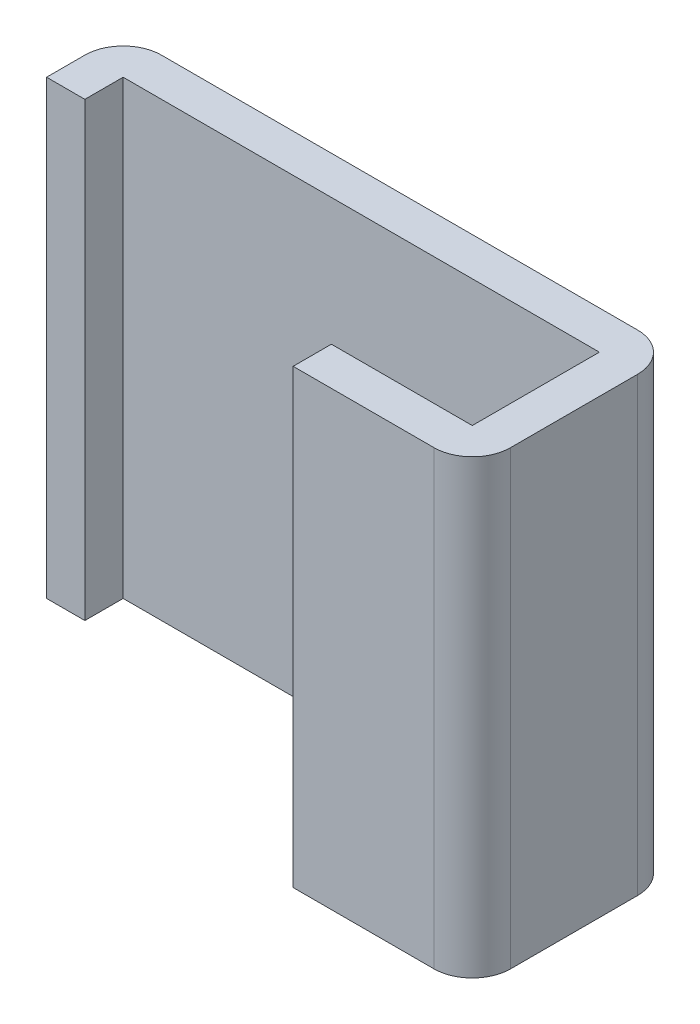
ISO-10303-21;
HEADER;
FILE_DESCRIPTION(('STEP AP214'),'2;1');
FILE_NAME('part.step','',(''),(''),'','','');
FILE_SCHEMA(('AUTOMOTIVE_DESIGN { 1 0 10303 214 1 1 1 1 }'));
ENDSEC;
DATA;
#1=APPLICATION_CONTEXT('core data for automotive mechanical design processes');
#2=APPLICATION_PROTOCOL_DEFINITION('international standard','automotive_design',2000,#1);
#3=PRODUCT_CONTEXT('',#1,'mechanical');
#4=PRODUCT('Part','Part','',(#3));
#5=PRODUCT_RELATED_PRODUCT_CATEGORY('part','',(#4));
#6=PRODUCT_DEFINITION_FORMATION('','',#4);
#7=PRODUCT_DEFINITION_CONTEXT('part definition',#1,'design');
#8=PRODUCT_DEFINITION('design','',#6,#7);
#9=PRODUCT_DEFINITION_SHAPE('','',#8);
#10=(LENGTH_UNIT() NAMED_UNIT(*) SI_UNIT(.MILLI.,.METRE.));
#11=(NAMED_UNIT(*) PLANE_ANGLE_UNIT() SI_UNIT($,.RADIAN.));
#12=(NAMED_UNIT(*) SI_UNIT($,.STERADIAN.) SOLID_ANGLE_UNIT());
#13=UNCERTAINTY_MEASURE_WITH_UNIT(LENGTH_MEASURE(1.E-05),#10,'distance_accuracy_value','');
#14=(GEOMETRIC_REPRESENTATION_CONTEXT(3) GLOBAL_UNCERTAINTY_ASSIGNED_CONTEXT((#13)) GLOBAL_UNIT_ASSIGNED_CONTEXT((#10,
#11,#12)) REPRESENTATION_CONTEXT('',''));
#15=CARTESIAN_POINT('',(0.,0.,0.));
#16=DIRECTION('',(0.,0.,1.));
#17=DIRECTION('',(1.,0.,0.));
#18=AXIS2_PLACEMENT_3D('',#15,#16,#17);
#19=CARTESIAN_POINT('',(-15.24,-9.094,1.08));
#20=DIRECTION('',(1.,0.,0.));
#21=DIRECTION('',(0.,0.,-1.));
#22=AXIS2_PLACEMENT_3D('',#19,#20,#21);
#23=PLANE('',#22);
#24=DIRECTION('',(0.,1.,0.));
#25=VECTOR('',#24,1.);
#26=CARTESIAN_POINT('',(-15.24,-9.094,1.33));
#27=LINE('',#26,#25);
#28=CARTESIAN_POINT('',(-15.24,-6.146,1.33));
#29=VERTEX_POINT('',#28);
#30=CARTESIAN_POINT('',(-15.24,-9.094,1.33));
#31=VERTEX_POINT('',#30);
#32=EDGE_CURVE('E98',#29,#31,#27,.F.);
#33=ORIENTED_EDGE('',*,*,#32,.F.);
#34=DIRECTION('',(0.,0.,-1.));
#35=VECTOR('',#34,1.);
#36=CARTESIAN_POINT('',(-15.24,-6.146,1.08));
#37=LINE('',#36,#35);
#38=CARTESIAN_POINT('',(-15.24,-6.146,1.08));
#39=VERTEX_POINT('',#38);
#40=EDGE_CURVE('E103',#39,#29,#37,.F.);
#41=ORIENTED_EDGE('',*,*,#40,.F.);
#42=DIRECTION('',(0.,1.,0.));
#43=VECTOR('',#42,1.);
#44=CARTESIAN_POINT('',(-15.24,-9.094,1.08));
#45=LINE('',#44,#43);
#46=CARTESIAN_POINT('',(-15.24,-9.094,1.08));
#47=VERTEX_POINT('',#46);
#48=EDGE_CURVE('E127',#39,#47,#45,.F.);
#49=ORIENTED_EDGE('',*,*,#48,.T.);
#50=DIRECTION('',(0.,0.,-1.));
#51=VECTOR('',#50,1.);
#52=CARTESIAN_POINT('',(-15.24,-9.094,1.08));
#53=LINE('',#52,#51);
#54=EDGE_CURVE('E84',#31,#47,#53,.T.);
#55=ORIENTED_EDGE('',*,*,#54,.F.);
#56=EDGE_LOOP('',(#33,#41,#49,#55));
#57=FACE_BOUND('',#56,.T.);
#58=ADVANCED_FACE('F17',(#57),#23,.F.);
#59=CARTESIAN_POINT('',(-14.32,-9.094,1.33));
#60=DIRECTION('',(0.,0.,1.));
#61=DIRECTION('',(1.,0.,0.));
#62=AXIS2_PLACEMENT_3D('',#59,#60,#61);
#63=PLANE('',#62);
#64=ORIENTED_EDGE('',*,*,#32,.T.);
#65=DIRECTION('',(1.,0.,0.));
#66=VECTOR('',#65,1.);
#67=CARTESIAN_POINT('',(-14.32,-9.094,1.33));
#68=LINE('',#67,#66);
#69=CARTESIAN_POINT('',(-14.32,-9.094,1.33));
#70=VERTEX_POINT('',#69);
#71=EDGE_CURVE('E78',#31,#70,#68,.T.);
#72=ORIENTED_EDGE('',*,*,#71,.T.);
#73=DIRECTION('',(0.,-1.,0.));
#74=VECTOR('',#73,1.);
#75=CARTESIAN_POINT('',(-14.32,-9.094,1.33));
#76=LINE('',#75,#74);
#77=CARTESIAN_POINT('',(-14.32,-6.146,1.33));
#78=VERTEX_POINT('',#77);
#79=EDGE_CURVE('E99',#78,#70,#76,.T.);
#80=ORIENTED_EDGE('',*,*,#79,.F.);
#81=DIRECTION('',(1.,0.,0.));
#82=VECTOR('',#81,1.);
#83=CARTESIAN_POINT('',(-14.32,-6.146,1.33));
#84=LINE('',#83,#82);
#85=EDGE_CURVE('E94',#78,#29,#84,.F.);
#86=ORIENTED_EDGE('',*,*,#85,.T.);
#87=EDGE_LOOP('',(#64,#72,#80,#86));
#88=FACE_BOUND('',#87,.T.);
#89=ADVANCED_FACE('F96',(#88),#63,.T.);
#90=CARTESIAN_POINT('',(-14.32,-9.094,1.08));
#91=DIRECTION('',(0.,0.,1.));
#92=DIRECTION('',(1.,0.,0.));
#93=AXIS2_PLACEMENT_3D('',#90,#91,#92);
#94=PLANE('',#93);
#95=ORIENTED_EDGE('',*,*,#48,.F.);
#96=DIRECTION('',(1.,0.,0.));
#97=VECTOR('',#96,1.);
#98=CARTESIAN_POINT('',(-14.32,-6.146,1.08));
#99=LINE('',#98,#97);
#100=CARTESIAN_POINT('',(-14.32,-6.146,1.08));
#101=VERTEX_POINT('',#100);
#102=EDGE_CURVE('E108',#101,#39,#99,.F.);
#103=ORIENTED_EDGE('',*,*,#102,.F.);
#104=DIRECTION('',(0.,1.,0.));
#105=VECTOR('',#104,1.);
#106=CARTESIAN_POINT('',(-14.32,-9.094,1.08));
#107=LINE('',#106,#105);
#108=CARTESIAN_POINT('',(-14.32,-9.094,1.08));
#109=VERTEX_POINT('',#108);
#110=EDGE_CURVE('E181',#101,#109,#107,.F.);
#111=ORIENTED_EDGE('',*,*,#110,.T.);
#112=DIRECTION('',(1.,0.,0.));
#113=VECTOR('',#112,1.);
#114=CARTESIAN_POINT('',(-14.32,-9.094,1.08));
#115=LINE('',#114,#113);
#116=EDGE_CURVE('E125',#47,#109,#115,.T.);
#117=ORIENTED_EDGE('',*,*,#116,.F.);
#118=EDGE_LOOP('',(#95,#103,#111,#117));
#119=FACE_BOUND('',#118,.T.);
#120=ADVANCED_FACE('F379',(#119),#94,.F.);
#121=CARTESIAN_POINT('',(-14.32,-9.094,1.08));
#122=DIRECTION('',(0.,-1.,0.));
#123=DIRECTION('',(0.,0.,-1.));
#124=AXIS2_PLACEMENT_3D('',#121,#122,#123);
#125=CYLINDRICAL_SURFACE('',#124,0.25);
#126=CARTESIAN_POINT('',(-14.32,-6.146,1.08));
#127=DIRECTION('',(0.,-1.,0.));
#128=DIRECTION('',(0.,0.,-1.));
#129=AXIS2_PLACEMENT_3D('',#126,#127,#128);
#130=CIRCLE('',#129,0.25);
#131=CARTESIAN_POINT('',(-14.07,-6.146,1.08));
#132=VERTEX_POINT('',#131);
#133=EDGE_CURVE('E147',#132,#78,#130,.T.);
#134=ORIENTED_EDGE('',*,*,#133,.T.);
#135=ORIENTED_EDGE('',*,*,#79,.T.);
#136=CARTESIAN_POINT('',(-14.32,-9.094,1.08));
#137=DIRECTION('',(0.,-1.,0.));
#138=DIRECTION('',(0.,0.,-1.));
#139=AXIS2_PLACEMENT_3D('',#136,#137,#138);
#140=CIRCLE('',#139,0.25);
#141=CARTESIAN_POINT('',(-14.07,-9.094,1.08));
#142=VERTEX_POINT('',#141);
#143=EDGE_CURVE('E20',#70,#142,#140,.F.);
#144=ORIENTED_EDGE('',*,*,#143,.T.);
#145=DIRECTION('',(0.,1.,0.));
#146=VECTOR('',#145,1.);
#147=CARTESIAN_POINT('',(-14.07,-9.094,1.08));
#148=LINE('',#147,#146);
#149=EDGE_CURVE('E156',#142,#132,#148,.T.);
#150=ORIENTED_EDGE('',*,*,#149,.T.);
#151=EDGE_LOOP('',(#134,#135,#144,#150));
#152=FACE_BOUND('',#151,.T.);
#153=ADVANCED_FACE('F155',(#152),#125,.T.);
#154=CARTESIAN_POINT('',(-17.68,-9.094,0.5));
#155=DIRECTION('',(0.,0.,-1.));
#156=DIRECTION('',(-1.,0.,0.));
#157=AXIS2_PLACEMENT_3D('',#154,#155,#156);
#158=PLANE('',#157);
#159=DIRECTION('',(0.,1.,0.));
#160=VECTOR('',#159,1.);
#161=CARTESIAN_POINT('',(-17.43,-9.094,0.5));
#162=LINE('',#161,#160);
#163=CARTESIAN_POINT('',(-17.43,-9.094,0.5));
#164=VERTEX_POINT('',#163);
#165=CARTESIAN_POINT('',(-17.43,-6.146,0.5));
#166=VERTEX_POINT('',#165);
#167=EDGE_CURVE('E194',#164,#166,#162,.T.);
#168=ORIENTED_EDGE('',*,*,#167,.T.);
#169=DIRECTION('',(-1.,0.,0.));
#170=VECTOR('',#169,1.);
#171=CARTESIAN_POINT('',(-17.68,-6.146,0.5));
#172=LINE('',#171,#170);
#173=CARTESIAN_POINT('',(-17.68,-6.146,0.5));
#174=VERTEX_POINT('',#173);
#175=EDGE_CURVE('E150',#174,#166,#172,.F.);
#176=ORIENTED_EDGE('',*,*,#175,.F.);
#177=DIRECTION('',(0.,1.,0.));
#178=VECTOR('',#177,1.);
#179=CARTESIAN_POINT('',(-17.68,-9.094,0.5));
#180=LINE('',#179,#178);
#181=CARTESIAN_POINT('',(-17.68,-9.094,0.5));
#182=VERTEX_POINT('',#181);
#183=EDGE_CURVE('E171',#174,#182,#180,.F.);
#184=ORIENTED_EDGE('',*,*,#183,.T.);
#185=DIRECTION('',(-1.,0.,0.));
#186=VECTOR('',#185,1.);
#187=CARTESIAN_POINT('',(-17.68,-9.094,0.5));
#188=LINE('',#187,#186);
#189=EDGE_CURVE('E189',#164,#182,#188,.T.);
#190=ORIENTED_EDGE('',*,*,#189,.F.);
#191=EDGE_LOOP('',(#168,#176,#184,#190));
#192=FACE_BOUND('',#191,.T.);
#193=ADVANCED_FACE('F278',(#192),#158,.F.);
#194=CARTESIAN_POINT('',(-17.43,-9.094,0.5));
#195=DIRECTION('',(-1.,0.,0.));
#196=DIRECTION('',(0.,0.,1.));
#197=AXIS2_PLACEMENT_3D('',#194,#195,#196);
#198=PLANE('',#197);
#199=DIRECTION('',(0.,1.,0.));
#200=VECTOR('',#199,1.);
#201=CARTESIAN_POINT('',(-17.43,-9.094,0.25));
#202=LINE('',#201,#200);
#203=CARTESIAN_POINT('',(-17.43,-9.094,0.25));
#204=VERTEX_POINT('',#203);
#205=CARTESIAN_POINT('',(-17.43,-6.146,0.25));
#206=VERTEX_POINT('',#205);
#207=EDGE_CURVE('E222',#204,#206,#202,.T.);
#208=ORIENTED_EDGE('',*,*,#207,.T.);
#209=DIRECTION('',(0.,0.,1.));
#210=VECTOR('',#209,1.);
#211=CARTESIAN_POINT('',(-17.43,-6.146,0.5));
#212=LINE('',#211,#210);
#213=EDGE_CURVE('E199',#166,#206,#212,.F.);
#214=ORIENTED_EDGE('',*,*,#213,.F.);
#215=ORIENTED_EDGE('',*,*,#167,.F.);
#216=DIRECTION('',(0.,0.,1.));
#217=VECTOR('',#216,1.);
#218=CARTESIAN_POINT('',(-17.43,-9.094,0.5));
#219=LINE('',#218,#217);
#220=EDGE_CURVE('E186',#204,#164,#219,.T.);
#221=ORIENTED_EDGE('',*,*,#220,.F.);
#222=EDGE_LOOP('',(#208,#214,#215,#221));
#223=FACE_BOUND('',#222,.T.);
#224=ADVANCED_FACE('F223',(#223),#198,.F.);
#225=CARTESIAN_POINT('',(-14.32,-9.094,0.25));
#226=DIRECTION('',(1.,0.,0.));
#227=DIRECTION('',(0.,0.,-1.));
#228=AXIS2_PLACEMENT_3D('',#225,#226,#227);
#229=PLANE('',#228);
#230=ORIENTED_EDGE('',*,*,#110,.F.);
#231=DIRECTION('',(0.,0.,-1.));
#232=VECTOR('',#231,1.);
#233=CARTESIAN_POINT('',(-14.32,-6.146,0.25));
#234=LINE('',#233,#232);
#235=CARTESIAN_POINT('',(-14.32,-6.146,0.25));
#236=VERTEX_POINT('',#235);
#237=EDGE_CURVE('E184',#236,#101,#234,.F.);
#238=ORIENTED_EDGE('',*,*,#237,.F.);
#239=DIRECTION('',(0.,1.,0.));
#240=VECTOR('',#239,1.);
#241=CARTESIAN_POINT('',(-14.32,-9.094,0.25));
#242=LINE('',#241,#240);
#243=CARTESIAN_POINT('',(-14.32,-9.094,0.25));
#244=VERTEX_POINT('',#243);
#245=EDGE_CURVE('E227',#236,#244,#242,.F.);
#246=ORIENTED_EDGE('',*,*,#245,.T.);
#247=DIRECTION('',(0.,0.,-1.));
#248=VECTOR('',#247,1.);
#249=CARTESIAN_POINT('',(-14.32,-9.094,0.25));
#250=LINE('',#249,#248);
#251=EDGE_CURVE('E166',#109,#244,#250,.T.);
#252=ORIENTED_EDGE('',*,*,#251,.F.);
#253=EDGE_LOOP('',(#230,#238,#246,#252));
#254=FACE_BOUND('',#253,.T.);
#255=ADVANCED_FACE('F349',(#254),#229,.F.);
#256=CARTESIAN_POINT('',(-14.07,-9.094,1.08));
#257=DIRECTION('',(-1.,0.,0.));
#258=DIRECTION('',(0.,0.,1.));
#259=AXIS2_PLACEMENT_3D('',#256,#257,#258);
#260=PLANE('',#259);
#261=DIRECTION('',(0.,-1.,0.));
#262=VECTOR('',#261,1.);
#263=CARTESIAN_POINT('',(-14.07,-9.094,0.25));
#264=LINE('',#263,#262);
#265=CARTESIAN_POINT('',(-14.07,-6.146,0.25));
#266=VERTEX_POINT('',#265);
#267=CARTESIAN_POINT('',(-14.07,-9.094,0.25));
#268=VERTEX_POINT('',#267);
#269=EDGE_CURVE('E146',#266,#268,#264,.T.);
#270=ORIENTED_EDGE('',*,*,#269,.F.);
#271=DIRECTION('',(0.,0.,1.));
#272=VECTOR('',#271,1.);
#273=CARTESIAN_POINT('',(-14.07,-6.146,1.08));
#274=LINE('',#273,#272);
#275=EDGE_CURVE('E165',#132,#266,#274,.F.);
#276=ORIENTED_EDGE('',*,*,#275,.F.);
#277=ORIENTED_EDGE('',*,*,#149,.F.);
#278=DIRECTION('',(0.,0.,1.));
#279=VECTOR('',#278,1.);
#280=CARTESIAN_POINT('',(-14.07,-9.094,1.08));
#281=LINE('',#280,#279);
#282=EDGE_CURVE('E163',#268,#142,#281,.T.);
#283=ORIENTED_EDGE('',*,*,#282,.F.);
#284=EDGE_LOOP('',(#270,#276,#277,#283));
#285=FACE_BOUND('',#284,.T.);
#286=ADVANCED_FACE('F162',(#285),#260,.F.);
#287=CARTESIAN_POINT('',(-17.68,-9.094,0.25));
#288=DIRECTION('',(1.,0.,0.));
#289=DIRECTION('',(0.,0.,-1.));
#290=AXIS2_PLACEMENT_3D('',#287,#288,#289);
#291=PLANE('',#290);
#292=ORIENTED_EDGE('',*,*,#183,.F.);
#293=DIRECTION('',(0.,0.,1.));
#294=VECTOR('',#293,1.);
#295=CARTESIAN_POINT('',(-17.68,-6.146,0.25));
#296=LINE('',#295,#294);
#297=CARTESIAN_POINT('',(-17.68,-6.146,0.25));
#298=VERTEX_POINT('',#297);
#299=EDGE_CURVE('E145',#298,#174,#296,.T.);
#300=ORIENTED_EDGE('',*,*,#299,.F.);
#301=DIRECTION('',(0.,-1.,0.));
#302=VECTOR('',#301,1.);
#303=CARTESIAN_POINT('',(-17.68,-9.094,0.25));
#304=LINE('',#303,#302);
#305=CARTESIAN_POINT('',(-17.68,-9.094,0.25));
#306=VERTEX_POINT('',#305);
#307=EDGE_CURVE('E143',#306,#298,#304,.F.);
#308=ORIENTED_EDGE('',*,*,#307,.F.);
#309=DIRECTION('',(0.,0.,-1.));
#310=VECTOR('',#309,1.);
#311=CARTESIAN_POINT('',(-17.68,-9.094,0.25));
#312=LINE('',#311,#310);
#313=EDGE_CURVE('E174',#182,#306,#312,.T.);
#314=ORIENTED_EDGE('',*,*,#313,.F.);
#315=EDGE_LOOP('',(#292,#300,#308,#314));
#316=FACE_BOUND('',#315,.T.);
#317=ADVANCED_FACE('F252',(#316),#291,.F.);
#318=CARTESIAN_POINT('',(-17.43,-9.094,0.25));
#319=DIRECTION('',(0.,0.,-1.));
#320=DIRECTION('',(-1.,0.,0.));
#321=AXIS2_PLACEMENT_3D('',#318,#319,#320);
#322=PLANE('',#321);
#323=ORIENTED_EDGE('',*,*,#245,.F.);
#324=DIRECTION('',(1.,0.,0.));
#325=VECTOR('',#324,1.);
#326=CARTESIAN_POINT('',(-14.32,-6.146,0.25));
#327=LINE('',#326,#325);
#328=EDGE_CURVE('E213',#206,#236,#327,.T.);
#329=ORIENTED_EDGE('',*,*,#328,.F.);
#330=ORIENTED_EDGE('',*,*,#207,.F.);
#331=DIRECTION('',(1.,0.,0.));
#332=VECTOR('',#331,1.);
#333=CARTESIAN_POINT('',(-14.32,-9.094,0.25));
#334=LINE('',#333,#332);
#335=EDGE_CURVE('E137',#204,#244,#334,.T.);
#336=ORIENTED_EDGE('',*,*,#335,.T.);
#337=EDGE_LOOP('',(#323,#329,#330,#336));
#338=FACE_BOUND('',#337,.T.);
#339=ADVANCED_FACE('F230',(#338),#322,.F.);
#340=CARTESIAN_POINT('',(-14.32,-9.094,0.25));
#341=DIRECTION('',(0.,-1.,0.));
#342=DIRECTION('',(0.,0.,-1.));
#343=AXIS2_PLACEMENT_3D('',#340,#341,#342);
#344=CYLINDRICAL_SURFACE('',#343,0.25);
#345=CARTESIAN_POINT('',(-14.32,-6.146,0.25));
#346=DIRECTION('',(0.,-1.,0.));
#347=DIRECTION('',(0.,0.,-1.));
#348=AXIS2_PLACEMENT_3D('',#345,#346,#347);
#349=CIRCLE('',#348,0.25);
#350=CARTESIAN_POINT('',(-14.32,-6.146,0.));
#351=VERTEX_POINT('',#350);
#352=EDGE_CURVE('E144',#266,#351,#349,.F.);
#353=ORIENTED_EDGE('',*,*,#352,.F.);
#354=ORIENTED_EDGE('',*,*,#269,.T.);
#355=CARTESIAN_POINT('',(-14.32,-9.094,0.25));
#356=DIRECTION('',(0.,-1.,0.));
#357=DIRECTION('',(0.,0.,-1.));
#358=AXIS2_PLACEMENT_3D('',#355,#356,#357);
#359=CIRCLE('',#358,0.25);
#360=CARTESIAN_POINT('',(-14.32,-9.094,0.));
#361=VERTEX_POINT('',#360);
#362=EDGE_CURVE('E138',#268,#361,#359,.F.);
#363=ORIENTED_EDGE('',*,*,#362,.T.);
#364=DIRECTION('',(0.,1.,0.));
#365=VECTOR('',#364,1.);
#366=CARTESIAN_POINT('',(-14.32,-9.094,0.));
#367=LINE('',#366,#365);
#368=EDGE_CURVE('E262',#361,#351,#367,.T.);
#369=ORIENTED_EDGE('',*,*,#368,.T.);
#370=EDGE_LOOP('',(#353,#354,#363,#369));
#371=FACE_BOUND('',#370,.T.);
#372=ADVANCED_FACE('F280',(#371),#344,.T.);
#373=CARTESIAN_POINT('',(-14.32,-6.146,0.25));
#374=DIRECTION('',(0.,1.,0.));
#375=DIRECTION('',(0.,0.,1.));
#376=AXIS2_PLACEMENT_3D('',#373,#374,#375);
#377=PLANE('',#376);
#378=ORIENTED_EDGE('',*,*,#213,.T.);
#379=ORIENTED_EDGE('',*,*,#328,.T.);
#380=ORIENTED_EDGE('',*,*,#237,.T.);
#381=ORIENTED_EDGE('',*,*,#102,.T.);
#382=ORIENTED_EDGE('',*,*,#40,.T.);
#383=ORIENTED_EDGE('',*,*,#85,.F.);
#384=ORIENTED_EDGE('',*,*,#133,.F.);
#385=ORIENTED_EDGE('',*,*,#275,.T.);
#386=ORIENTED_EDGE('',*,*,#352,.T.);
#387=DIRECTION('',(1.,0.,0.));
#388=VECTOR('',#387,1.);
#389=CARTESIAN_POINT('',(-14.32,-6.146,0.));
#390=LINE('',#389,#388);
#391=CARTESIAN_POINT('',(-17.43,-6.146,0.));
#392=VERTEX_POINT('',#391);
#393=EDGE_CURVE('E236',#351,#392,#390,.F.);
#394=ORIENTED_EDGE('',*,*,#393,.T.);
#395=CARTESIAN_POINT('',(-17.43,-6.146,0.25));
#396=DIRECTION('',(0.,-1.,0.));
#397=DIRECTION('',(0.,0.,-1.));
#398=AXIS2_PLACEMENT_3D('',#395,#396,#397);
#399=CIRCLE('',#398,0.25);
#400=EDGE_CURVE('E141',#298,#392,#399,.T.);
#401=ORIENTED_EDGE('',*,*,#400,.F.);
#402=ORIENTED_EDGE('',*,*,#299,.T.);
#403=ORIENTED_EDGE('',*,*,#175,.T.);
#404=EDGE_LOOP('',(#378,#379,#380,#381,#382,#383,#384,#385,#386,#394,#401,#402,#403));
#405=FACE_BOUND('',#404,.T.);
#406=ADVANCED_FACE('F105',(#405),#377,.T.);
#407=CARTESIAN_POINT('',(-17.43,-9.094,0.25));
#408=DIRECTION('',(0.,-1.,0.));
#409=DIRECTION('',(0.,0.,-1.));
#410=AXIS2_PLACEMENT_3D('',#407,#408,#409);
#411=CYLINDRICAL_SURFACE('',#410,0.25);
#412=ORIENTED_EDGE('',*,*,#400,.T.);
#413=DIRECTION('',(0.,1.,0.));
#414=VECTOR('',#413,1.);
#415=CARTESIAN_POINT('',(-17.43,-9.094,0.));
#416=LINE('',#415,#414);
#417=CARTESIAN_POINT('',(-17.43,-9.094,0.));
#418=VERTEX_POINT('',#417);
#419=EDGE_CURVE('E26',#392,#418,#416,.F.);
#420=ORIENTED_EDGE('',*,*,#419,.T.);
#421=CARTESIAN_POINT('',(-17.43,-9.094,0.25));
#422=DIRECTION('',(0.,-1.,0.));
#423=DIRECTION('',(0.,0.,-1.));
#424=AXIS2_PLACEMENT_3D('',#421,#422,#423);
#425=CIRCLE('',#424,0.25);
#426=EDGE_CURVE('E34',#418,#306,#425,.F.);
#427=ORIENTED_EDGE('',*,*,#426,.T.);
#428=ORIENTED_EDGE('',*,*,#307,.T.);
#429=EDGE_LOOP('',(#412,#420,#427,#428));
#430=FACE_BOUND('',#429,.T.);
#431=ADVANCED_FACE('F256',(#430),#411,.T.);
#432=CARTESIAN_POINT('',(-14.32,-9.094,0.25));
#433=DIRECTION('',(0.,1.,0.));
#434=DIRECTION('',(0.,0.,1.));
#435=AXIS2_PLACEMENT_3D('',#432,#433,#434);
#436=PLANE('',#435);
#437=ORIENTED_EDGE('',*,*,#220,.T.);
#438=ORIENTED_EDGE('',*,*,#189,.T.);
#439=ORIENTED_EDGE('',*,*,#313,.T.);
#440=ORIENTED_EDGE('',*,*,#426,.F.);
#441=DIRECTION('',(1.,0.,0.));
#442=VECTOR('',#441,1.);
#443=CARTESIAN_POINT('',(-14.32,-9.094,0.));
#444=LINE('',#443,#442);
#445=EDGE_CURVE('E11',#418,#361,#444,.T.);
#446=ORIENTED_EDGE('',*,*,#445,.T.);
#447=ORIENTED_EDGE('',*,*,#362,.F.);
#448=ORIENTED_EDGE('',*,*,#282,.T.);
#449=ORIENTED_EDGE('',*,*,#143,.F.);
#450=ORIENTED_EDGE('',*,*,#71,.F.);
#451=ORIENTED_EDGE('',*,*,#54,.T.);
#452=ORIENTED_EDGE('',*,*,#116,.T.);
#453=ORIENTED_EDGE('',*,*,#251,.T.);
#454=ORIENTED_EDGE('',*,*,#335,.F.);
#455=EDGE_LOOP('',(#437,#438,#439,#440,#446,#447,#448,#449,#450,#451,#452,#453,#454));
#456=FACE_BOUND('',#455,.T.);
#457=ADVANCED_FACE('F170',(#456),#436,.F.);
#458=CARTESIAN_POINT('',(-14.32,-9.094,0.));
#459=DIRECTION('',(0.,0.,1.));
#460=DIRECTION('',(1.,0.,0.));
#461=AXIS2_PLACEMENT_3D('',#458,#459,#460);
#462=PLANE('',#461);
#463=ORIENTED_EDGE('',*,*,#419,.F.);
#464=ORIENTED_EDGE('',*,*,#393,.F.);
#465=ORIENTED_EDGE('',*,*,#368,.F.);
#466=ORIENTED_EDGE('',*,*,#445,.F.);
#467=EDGE_LOOP('',(#463,#464,#465,#466));
#468=FACE_BOUND('',#467,.T.);
#469=ADVANCED_FACE('F279',(#468),#462,.F.);
#470=CLOSED_SHELL('',(#58,#89,#120,#153,#193,#224,#255,#286,#317,#339,#372,#406,#431,#457,#469));
#471=MANIFOLD_SOLID_BREP('B1',#470);
#472=ADVANCED_BREP_SHAPE_REPRESENTATION('',(#18,#471),#14);
#473=SHAPE_DEFINITION_REPRESENTATION(#9,#472);
ENDSEC;
END-ISO-10303-21;
